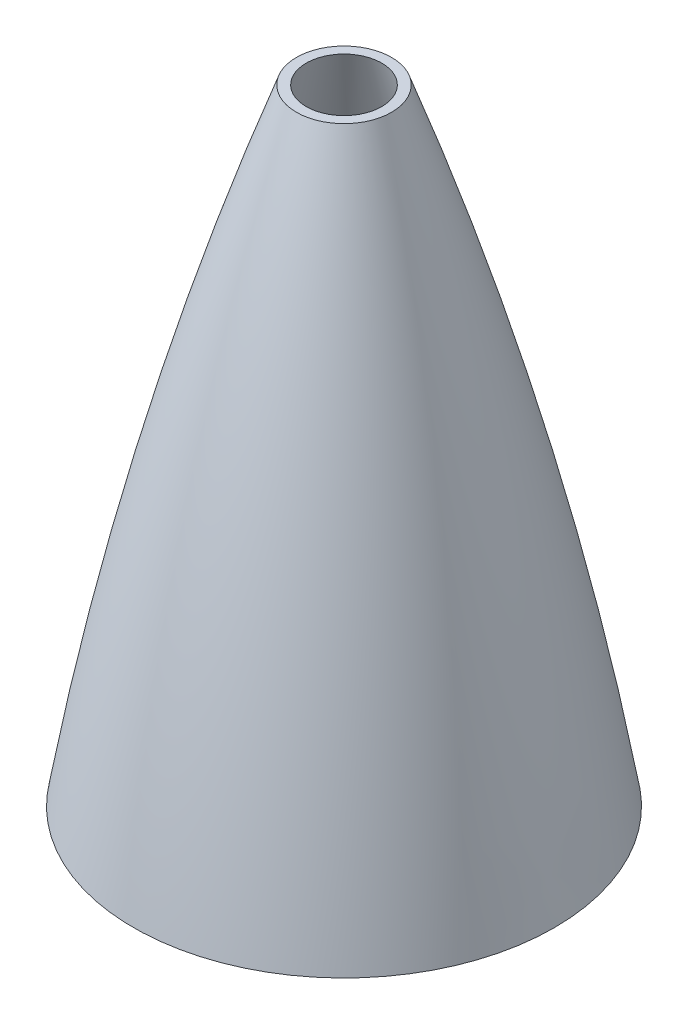
ISO-10303-21;
HEADER;
FILE_DESCRIPTION(('STEP AP214'),'2;1');
FILE_NAME('part.step','',(''),(''),'','','');
FILE_SCHEMA(('AUTOMOTIVE_DESIGN { 1 0 10303 214 1 1 1 1 }'));
ENDSEC;
DATA;
#1=APPLICATION_CONTEXT('core data for automotive mechanical design processes');
#2=APPLICATION_PROTOCOL_DEFINITION('international standard','automotive_design',2000,#1);
#3=PRODUCT_CONTEXT('',#1,'mechanical');
#4=PRODUCT('Part','Part','',(#3));
#5=PRODUCT_RELATED_PRODUCT_CATEGORY('part','',(#4));
#6=PRODUCT_DEFINITION_FORMATION('','',#4);
#7=PRODUCT_DEFINITION_CONTEXT('part definition',#1,'design');
#8=PRODUCT_DEFINITION('design','',#6,#7);
#9=PRODUCT_DEFINITION_SHAPE('','',#8);
#10=(LENGTH_UNIT() NAMED_UNIT(*) SI_UNIT(.MILLI.,.METRE.));
#11=(NAMED_UNIT(*) PLANE_ANGLE_UNIT() SI_UNIT($,.RADIAN.));
#12=(NAMED_UNIT(*) SI_UNIT($,.STERADIAN.) SOLID_ANGLE_UNIT());
#13=UNCERTAINTY_MEASURE_WITH_UNIT(LENGTH_MEASURE(1.E-05),#10,'distance_accuracy_value','');
#14=(GEOMETRIC_REPRESENTATION_CONTEXT(3) GLOBAL_UNCERTAINTY_ASSIGNED_CONTEXT((#13)) GLOBAL_UNIT_ASSIGNED_CONTEXT((#10,
#11,#12)) REPRESENTATION_CONTEXT('',''));
#15=CARTESIAN_POINT('',(0.,0.,0.));
#16=DIRECTION('',(0.,0.,1.));
#17=DIRECTION('',(1.,0.,0.));
#18=AXIS2_PLACEMENT_3D('',#15,#16,#17);
#19=CARTESIAN_POINT('',(2.22044604925031E-13,-77.7824394206784,0.));
#20=DIRECTION('',(0.,1.,0.));
#21=DIRECTION('',(-1.,0.,0.));
#22=AXIS2_PLACEMENT_3D('',#19,#20,#21);
#23=DEGENERATE_TOROIDAL_SURFACE('',#22,1014.39057082294,1093.36082838655,.F.);
#24=CARTESIAN_POINT('',(2.22044604925031E-13,292.1,0.));
#25=DIRECTION('',(0.,1.,0.));
#26=DIRECTION('',(0.,0.,1.));
#27=AXIS2_PLACEMENT_3D('',#24,#25,#26);
#28=CIRCLE('',#27,14.5044102408933);
#29=CARTESIAN_POINT('',(2.22044604925031E-13,292.1,14.5044102408933));
#30=VERTEX_POINT('',#29);
#31=EDGE_CURVE('E10',#30,#30,#28,.F.);
#32=ORIENTED_EDGE('',*,*,#31,.T.);
#33=EDGE_LOOP('',(#32));
#34=FACE_BOUND('',#33,.T.);
#35=CARTESIAN_POINT('',(5.29596787288722E-13,101.6,0.));
#36=DIRECTION('',(0.,-1.,0.));
#37=DIRECTION('',(1.,0.,0.));
#38=AXIS2_PLACEMENT_3D('',#35,#36,#37);
#39=CIRCLE('',#38,64.1546723067235);
#40=CARTESIAN_POINT('',(64.154672306724,101.6,0.));
#41=VERTEX_POINT('',#40);
#42=EDGE_CURVE('E52',#41,#41,#39,.F.);
#43=ORIENTED_EDGE('',*,*,#42,.T.);
#44=EDGE_LOOP('',(#43));
#45=FACE_BOUND('',#44,.T.);
#46=ADVANCED_FACE('F38',(#34,#45),#23,.F.);
#47=CARTESIAN_POINT('',(2.22044604925031E-13,-88.4854003678518,0.));
#48=DIRECTION('',(0.,1.,0.));
#49=DIRECTION('',(-1.,0.,0.));
#50=AXIS2_PLACEMENT_3D('',#47,#48,#49);
#51=DEGENERATE_TOROIDAL_SURFACE('',#50,1133.57722716672,1206.67591223346,.F.);
#52=CARTESIAN_POINT('',(2.22044604925031E-13,292.1,0.));
#53=DIRECTION('',(0.,1.,0.));
#54=DIRECTION('',(0.,0.,1.));
#55=AXIS2_PLACEMENT_3D('',#52,#53,#54);
#56=CIRCLE('',#55,11.5085819285119);
#57=CARTESIAN_POINT('',(2.22044604925031E-13,292.1,11.5085819285119));
#58=VERTEX_POINT('',#57);
#59=EDGE_CURVE('E46',#58,#58,#56,.T.);
#60=ORIENTED_EDGE('',*,*,#59,.T.);
#61=EDGE_LOOP('',(#60));
#62=FACE_BOUND('',#61,.T.);
#63=CARTESIAN_POINT('',(5.47947072900219E-13,101.6,0.));
#64=DIRECTION('',(0.,-1.,0.));
#65=DIRECTION('',(1.,0.,0.));
#66=AXIS2_PLACEMENT_3D('',#63,#64,#65);
#67=CIRCLE('',#66,58.0327332361936);
#68=CARTESIAN_POINT('',(58.0327332361942,101.6,0.));
#69=VERTEX_POINT('',#68);
#70=EDGE_CURVE('E41',#69,#69,#67,.T.);
#71=ORIENTED_EDGE('',*,*,#70,.T.);
#72=EDGE_LOOP('',(#71));
#73=FACE_BOUND('',#72,.T.);
#74=ADVANCED_FACE('F62',(#62,#73),#51,.T.);
#75=CARTESIAN_POINT('',(0.,292.1,0.));
#76=DIRECTION('',(0.,1.,0.));
#77=DIRECTION('',(0.,0.,1.));
#78=AXIS2_PLACEMENT_3D('',#75,#76,#77);
#79=PLANE('',#78);
#80=ORIENTED_EDGE('',*,*,#31,.F.);
#81=EDGE_LOOP('',(#80));
#82=FACE_BOUND('',#81,.T.);
#83=ORIENTED_EDGE('',*,*,#59,.F.);
#84=EDGE_LOOP('',(#83));
#85=FACE_BOUND('',#84,.T.);
#86=ADVANCED_FACE('F66',(#82,#85),#79,.T.);
#87=CARTESIAN_POINT('',(1.7419376071072E-13,101.6,0.));
#88=DIRECTION('',(0.,-1.,0.));
#89=DIRECTION('',(1.,0.,0.));
#90=AXIS2_PLACEMENT_3D('',#87,#88,#89);
#91=PLANE('',#90);
#92=ORIENTED_EDGE('',*,*,#42,.F.);
#93=EDGE_LOOP('',(#92));
#94=FACE_BOUND('',#93,.T.);
#95=ORIENTED_EDGE('',*,*,#70,.F.);
#96=EDGE_LOOP('',(#95));
#97=FACE_BOUND('',#96,.T.);
#98=ADVANCED_FACE('F64',(#94,#97),#91,.T.);
#99=CLOSED_SHELL('',(#46,#74,#86,#98));
#100=MANIFOLD_SOLID_BREP('B2',#99);
#101=ADVANCED_BREP_SHAPE_REPRESENTATION('',(#18,#100),#14);
#102=SHAPE_DEFINITION_REPRESENTATION(#9,#101);
ENDSEC;
END-ISO-10303-21;
